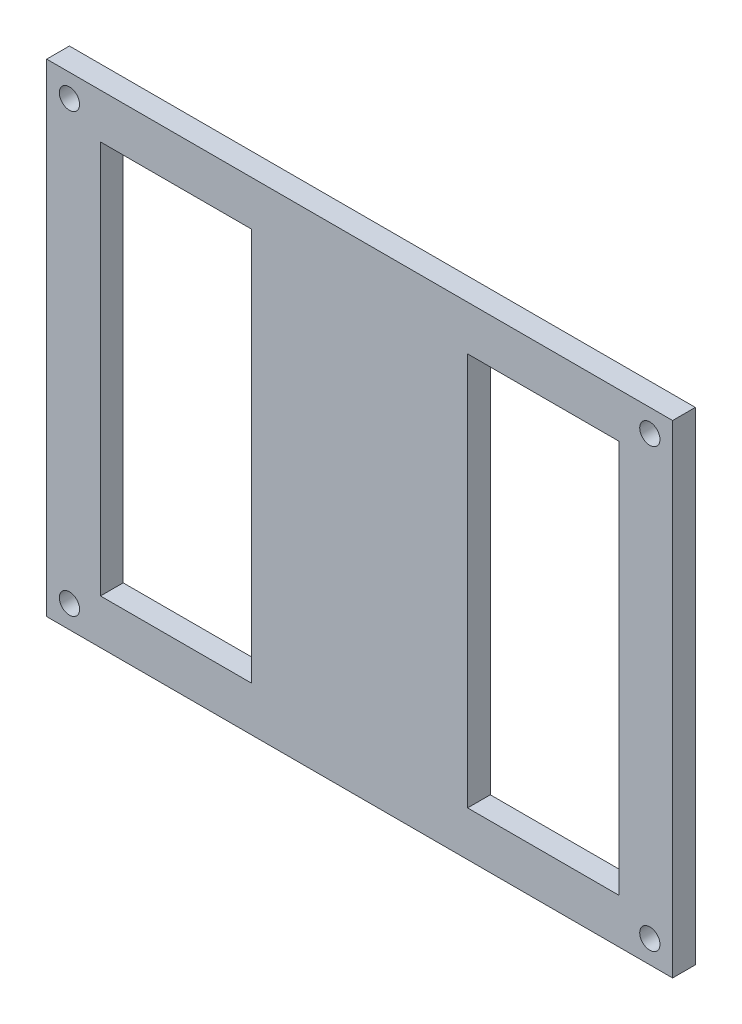
ISO-10303-21;
HEADER;
FILE_DESCRIPTION(('STEP AP214'),'2;1');
FILE_NAME('part.step','',(''),(''),'','','');
FILE_SCHEMA(('AUTOMOTIVE_DESIGN { 1 0 10303 214 1 1 1 1 }'));
ENDSEC;
DATA;
#1=APPLICATION_CONTEXT('core data for automotive mechanical design processes');
#2=APPLICATION_PROTOCOL_DEFINITION('international standard','automotive_design',2000,#1);
#3=PRODUCT_CONTEXT('',#1,'mechanical');
#4=PRODUCT('Part','Part','',(#3));
#5=PRODUCT_RELATED_PRODUCT_CATEGORY('part','',(#4));
#6=PRODUCT_DEFINITION_FORMATION('','',#4);
#7=PRODUCT_DEFINITION_CONTEXT('part definition',#1,'design');
#8=PRODUCT_DEFINITION('design','',#6,#7);
#9=PRODUCT_DEFINITION_SHAPE('','',#8);
#10=(LENGTH_UNIT() NAMED_UNIT(*) SI_UNIT(.MILLI.,.METRE.));
#11=(NAMED_UNIT(*) PLANE_ANGLE_UNIT() SI_UNIT($,.RADIAN.));
#12=(NAMED_UNIT(*) SI_UNIT($,.STERADIAN.) SOLID_ANGLE_UNIT());
#13=UNCERTAINTY_MEASURE_WITH_UNIT(LENGTH_MEASURE(1.E-05),#10,'distance_accuracy_value','');
#14=(GEOMETRIC_REPRESENTATION_CONTEXT(3) GLOBAL_UNCERTAINTY_ASSIGNED_CONTEXT((#13)) GLOBAL_UNIT_ASSIGNED_CONTEXT((#10,
#11,#12)) REPRESENTATION_CONTEXT('',''));
#15=CARTESIAN_POINT('',(0.,0.,0.));
#16=DIRECTION('',(0.,0.,1.));
#17=DIRECTION('',(1.,0.,0.));
#18=AXIS2_PLACEMENT_3D('',#15,#16,#17);
#19=CARTESIAN_POINT('',(0.,0.,0.));
#20=DIRECTION('',(0.,0.,1.));
#21=DIRECTION('',(1.,0.,0.));
#22=AXIS2_PLACEMENT_3D('',#19,#20,#21);
#23=PLANE('',#22);
#24=DIRECTION('',(1.,0.,0.));
#25=VECTOR('',#24,1.);
#26=CARTESIAN_POINT('',(-25.65,27.475,0.));
#27=LINE('',#26,#25);
#28=CARTESIAN_POINT('',(-36.215,27.475,0.));
#29=VERTEX_POINT('',#28);
#30=CARTESIAN_POINT('',(-15.085,27.475,0.));
#31=VERTEX_POINT('',#30);
#32=EDGE_CURVE('E243',#29,#31,#27,.T.);
#33=ORIENTED_EDGE('',*,*,#32,.F.);
#34=DIRECTION('',(0.,1.,0.));
#35=VECTOR('',#34,1.);
#36=CARTESIAN_POINT('',(-36.215,0.,0.));
#37=LINE('',#36,#35);
#38=CARTESIAN_POINT('',(-36.215,-27.475,0.));
#39=VERTEX_POINT('',#38);
#40=EDGE_CURVE('E55',#39,#29,#37,.T.);
#41=ORIENTED_EDGE('',*,*,#40,.F.);
#42=DIRECTION('',(-1.,0.,0.));
#43=VECTOR('',#42,1.);
#44=CARTESIAN_POINT('',(-15.085,-27.475,0.));
#45=LINE('',#44,#43);
#46=CARTESIAN_POINT('',(-15.085,-27.475,0.));
#47=VERTEX_POINT('',#46);
#48=EDGE_CURVE('E267',#47,#39,#45,.T.);
#49=ORIENTED_EDGE('',*,*,#48,.F.);
#50=DIRECTION('',(0.,1.,0.));
#51=VECTOR('',#50,1.);
#52=CARTESIAN_POINT('',(-15.085,0.,0.));
#53=LINE('',#52,#51);
#54=EDGE_CURVE('E145',#47,#31,#53,.T.);
#55=ORIENTED_EDGE('',*,*,#54,.T.);
#56=EDGE_LOOP('',(#33,#41,#49,#55));
#57=FACE_BOUND('',#56,.T.);
#58=DIRECTION('',(1.,0.,0.));
#59=VECTOR('',#58,1.);
#60=CARTESIAN_POINT('',(25.65,27.475,0.));
#61=LINE('',#60,#59);
#62=CARTESIAN_POINT('',(15.085,27.475,0.));
#63=VERTEX_POINT('',#62);
#64=CARTESIAN_POINT('',(36.215,27.475,0.));
#65=VERTEX_POINT('',#64);
#66=EDGE_CURVE('E257',#63,#65,#61,.T.);
#67=ORIENTED_EDGE('',*,*,#66,.F.);
#68=DIRECTION('',(0.,1.,0.));
#69=VECTOR('',#68,1.);
#70=CARTESIAN_POINT('',(15.085,0.,0.));
#71=LINE('',#70,#69);
#72=CARTESIAN_POINT('',(15.085,-27.475,0.));
#73=VERTEX_POINT('',#72);
#74=EDGE_CURVE('E140',#73,#63,#71,.T.);
#75=ORIENTED_EDGE('',*,*,#74,.F.);
#76=DIRECTION('',(-1.,0.,0.));
#77=VECTOR('',#76,1.);
#78=CARTESIAN_POINT('',(36.215,-27.475,0.));
#79=LINE('',#78,#77);
#80=CARTESIAN_POINT('',(36.215,-27.475,0.));
#81=VERTEX_POINT('',#80);
#82=EDGE_CURVE('E125',#81,#73,#79,.T.);
#83=ORIENTED_EDGE('',*,*,#82,.F.);
#84=DIRECTION('',(0.,1.,0.));
#85=VECTOR('',#84,1.);
#86=CARTESIAN_POINT('',(36.215,0.,0.));
#87=LINE('',#86,#85);
#88=EDGE_CURVE('E138',#81,#65,#87,.T.);
#89=ORIENTED_EDGE('',*,*,#88,.T.);
#90=EDGE_LOOP('',(#67,#75,#83,#89));
#91=FACE_BOUND('',#90,.T.);
#92=CARTESIAN_POINT('',(40.5530194846605,30.5530194846606,0.));
#93=DIRECTION('',(0.,0.,1.));
#94=DIRECTION('',(1.,0.,0.));
#95=AXIS2_PLACEMENT_3D('',#92,#93,#94);
#96=CIRCLE('',#95,1.415);
#97=CARTESIAN_POINT('',(41.9680194846605,30.5530194846606,0.));
#98=VERTEX_POINT('',#97);
#99=EDGE_CURVE('E175',#98,#98,#96,.T.);
#100=ORIENTED_EDGE('',*,*,#99,.T.);
#101=EDGE_LOOP('',(#100));
#102=FACE_BOUND('',#101,.T.);
#103=CARTESIAN_POINT('',(40.5530194846605,-30.5530194846605,0.));
#104=DIRECTION('',(0.,0.,1.));
#105=DIRECTION('',(1.,0.,0.));
#106=AXIS2_PLACEMENT_3D('',#103,#104,#105);
#107=CIRCLE('',#106,1.415);
#108=CARTESIAN_POINT('',(41.9680194846605,-30.5530194846605,0.));
#109=VERTEX_POINT('',#108);
#110=EDGE_CURVE('E172',#109,#109,#107,.T.);
#111=ORIENTED_EDGE('',*,*,#110,.T.);
#112=EDGE_LOOP('',(#111));
#113=FACE_BOUND('',#112,.T.);
#114=CARTESIAN_POINT('',(-40.5530194846605,-30.5530194846606,0.));
#115=DIRECTION('',(0.,0.,1.));
#116=DIRECTION('',(1.,0.,0.));
#117=AXIS2_PLACEMENT_3D('',#114,#115,#116);
#118=CIRCLE('',#117,1.415);
#119=CARTESIAN_POINT('',(-39.1380194846605,-30.5530194846606,0.));
#120=VERTEX_POINT('',#119);
#121=EDGE_CURVE('E169',#120,#120,#118,.T.);
#122=ORIENTED_EDGE('',*,*,#121,.T.);
#123=EDGE_LOOP('',(#122));
#124=FACE_BOUND('',#123,.T.);
#125=CARTESIAN_POINT('',(-40.5530194846605,30.5530194846606,0.));
#126=DIRECTION('',(0.,0.,1.));
#127=DIRECTION('',(1.,0.,0.));
#128=AXIS2_PLACEMENT_3D('',#125,#126,#127);
#129=CIRCLE('',#128,1.415);
#130=CARTESIAN_POINT('',(-39.1380194846605,30.5530194846606,0.));
#131=VERTEX_POINT('',#130);
#132=EDGE_CURVE('E166',#131,#131,#129,.T.);
#133=ORIENTED_EDGE('',*,*,#132,.T.);
#134=EDGE_LOOP('',(#133));
#135=FACE_BOUND('',#134,.T.);
#136=DIRECTION('',(0.,1.,0.));
#137=VECTOR('',#136,1.);
#138=CARTESIAN_POINT('',(43.735,0.,0.));
#139=LINE('',#138,#137);
#140=CARTESIAN_POINT('',(43.735,-33.735,0.));
#141=VERTEX_POINT('',#140);
#142=CARTESIAN_POINT('',(43.735,33.735,0.));
#143=VERTEX_POINT('',#142);
#144=EDGE_CURVE('E11',#141,#143,#139,.T.);
#145=ORIENTED_EDGE('',*,*,#144,.F.);
#146=DIRECTION('',(1.,0.,0.));
#147=VECTOR('',#146,1.);
#148=CARTESIAN_POINT('',(0.,-33.735,0.));
#149=LINE('',#148,#147);
#150=CARTESIAN_POINT('',(-43.735,-33.735,0.));
#151=VERTEX_POINT('',#150);
#152=EDGE_CURVE('E43',#151,#141,#149,.T.);
#153=ORIENTED_EDGE('',*,*,#152,.F.);
#154=DIRECTION('',(0.,-1.,0.));
#155=VECTOR('',#154,1.);
#156=CARTESIAN_POINT('',(-43.735,0.,0.));
#157=LINE('',#156,#155);
#158=CARTESIAN_POINT('',(-43.735,33.735,0.));
#159=VERTEX_POINT('',#158);
#160=EDGE_CURVE('E201',#159,#151,#157,.T.);
#161=ORIENTED_EDGE('',*,*,#160,.F.);
#162=DIRECTION('',(-1.,0.,0.));
#163=VECTOR('',#162,1.);
#164=CARTESIAN_POINT('',(0.,33.735,0.));
#165=LINE('',#164,#163);
#166=EDGE_CURVE('E193',#143,#159,#165,.T.);
#167=ORIENTED_EDGE('',*,*,#166,.F.);
#168=EDGE_LOOP('',(#145,#153,#161,#167));
#169=FACE_BOUND('',#168,.T.);
#170=ADVANCED_FACE('F36',(#57,#91,#102,#113,#124,#135,#169),#23,.F.);
#171=CARTESIAN_POINT('',(43.735,33.735,-6.825));
#172=DIRECTION('',(1.,0.,0.));
#173=DIRECTION('',(0.,1.,0.));
#174=AXIS2_PLACEMENT_3D('',#171,#172,#173);
#175=PLANE('',#174);
#176=ORIENTED_EDGE('',*,*,#144,.T.);
#177=DIRECTION('',(0.,0.,1.));
#178=VECTOR('',#177,1.);
#179=CARTESIAN_POINT('',(43.735,33.735,-6.825));
#180=LINE('',#179,#178);
#181=CARTESIAN_POINT('',(43.735,33.735,3.175));
#182=VERTEX_POINT('',#181);
#183=EDGE_CURVE('E190',#143,#182,#180,.T.);
#184=ORIENTED_EDGE('',*,*,#183,.T.);
#185=DIRECTION('',(0.,1.,0.));
#186=VECTOR('',#185,1.);
#187=CARTESIAN_POINT('',(43.735,33.735,3.175));
#188=LINE('',#187,#186);
#189=CARTESIAN_POINT('',(43.735,-33.735,3.175));
#190=VERTEX_POINT('',#189);
#191=EDGE_CURVE('E178',#190,#182,#188,.T.);
#192=ORIENTED_EDGE('',*,*,#191,.F.);
#193=DIRECTION('',(0.,0.,1.));
#194=VECTOR('',#193,1.);
#195=CARTESIAN_POINT('',(43.735,-33.735,-6.825));
#196=LINE('',#195,#194);
#197=EDGE_CURVE('E191',#141,#190,#196,.T.);
#198=ORIENTED_EDGE('',*,*,#197,.F.);
#199=EDGE_LOOP('',(#176,#184,#192,#198));
#200=FACE_BOUND('',#199,.T.);
#201=ADVANCED_FACE('F213',(#200),#175,.T.);
#202=CARTESIAN_POINT('',(-43.735,-33.735,-6.825));
#203=DIRECTION('',(0.,-1.,0.));
#204=DIRECTION('',(0.,0.,-1.));
#205=AXIS2_PLACEMENT_3D('',#202,#203,#204);
#206=PLANE('',#205);
#207=ORIENTED_EDGE('',*,*,#152,.T.);
#208=ORIENTED_EDGE('',*,*,#197,.T.);
#209=DIRECTION('',(1.,0.,0.));
#210=VECTOR('',#209,1.);
#211=CARTESIAN_POINT('',(-43.735,-33.735,3.175));
#212=LINE('',#211,#210);
#213=CARTESIAN_POINT('',(-43.735,-33.735,3.175));
#214=VERTEX_POINT('',#213);
#215=EDGE_CURVE('E187',#214,#190,#212,.T.);
#216=ORIENTED_EDGE('',*,*,#215,.F.);
#217=DIRECTION('',(0.,0.,1.));
#218=VECTOR('',#217,1.);
#219=CARTESIAN_POINT('',(-43.735,-33.735,-6.825));
#220=LINE('',#219,#218);
#221=EDGE_CURVE('E194',#151,#214,#220,.T.);
#222=ORIENTED_EDGE('',*,*,#221,.F.);
#223=EDGE_LOOP('',(#207,#208,#216,#222));
#224=FACE_BOUND('',#223,.T.);
#225=ADVANCED_FACE('F206',(#224),#206,.T.);
#226=CARTESIAN_POINT('',(-43.735,33.735,-6.825));
#227=DIRECTION('',(-1.,0.,0.));
#228=DIRECTION('',(0.,-1.,0.));
#229=AXIS2_PLACEMENT_3D('',#226,#227,#228);
#230=PLANE('',#229);
#231=ORIENTED_EDGE('',*,*,#160,.T.);
#232=ORIENTED_EDGE('',*,*,#221,.T.);
#233=DIRECTION('',(0.,-1.,0.));
#234=VECTOR('',#233,1.);
#235=CARTESIAN_POINT('',(-43.735,33.735,3.175));
#236=LINE('',#235,#234);
#237=CARTESIAN_POINT('',(-43.735,33.735,3.175));
#238=VERTEX_POINT('',#237);
#239=EDGE_CURVE('E184',#238,#214,#236,.T.);
#240=ORIENTED_EDGE('',*,*,#239,.F.);
#241=DIRECTION('',(0.,0.,1.));
#242=VECTOR('',#241,1.);
#243=CARTESIAN_POINT('',(-43.735,33.735,-6.825));
#244=LINE('',#243,#242);
#245=EDGE_CURVE('E196',#159,#238,#244,.T.);
#246=ORIENTED_EDGE('',*,*,#245,.F.);
#247=EDGE_LOOP('',(#231,#232,#240,#246));
#248=FACE_BOUND('',#247,.T.);
#249=ADVANCED_FACE('F220',(#248),#230,.T.);
#250=CARTESIAN_POINT('',(-43.735,33.735,-6.825));
#251=DIRECTION('',(0.,1.,0.));
#252=DIRECTION('',(0.,0.,1.));
#253=AXIS2_PLACEMENT_3D('',#250,#251,#252);
#254=PLANE('',#253);
#255=ORIENTED_EDGE('',*,*,#166,.T.);
#256=ORIENTED_EDGE('',*,*,#245,.T.);
#257=DIRECTION('',(-1.,0.,0.));
#258=VECTOR('',#257,1.);
#259=CARTESIAN_POINT('',(-43.735,33.735,3.175));
#260=LINE('',#259,#258);
#261=EDGE_CURVE('E181',#182,#238,#260,.T.);
#262=ORIENTED_EDGE('',*,*,#261,.F.);
#263=ORIENTED_EDGE('',*,*,#183,.F.);
#264=EDGE_LOOP('',(#255,#256,#262,#263));
#265=FACE_BOUND('',#264,.T.);
#266=ADVANCED_FACE('F217',(#265),#254,.T.);
#267=CARTESIAN_POINT('',(0.,0.,3.175));
#268=DIRECTION('',(0.,0.,1.));
#269=DIRECTION('',(1.,0.,0.));
#270=AXIS2_PLACEMENT_3D('',#267,#268,#269);
#271=PLANE('',#270);
#272=DIRECTION('',(0.,1.,0.));
#273=VECTOR('',#272,1.);
#274=CARTESIAN_POINT('',(-36.215,-32.565,3.175));
#275=LINE('',#274,#273);
#276=CARTESIAN_POINT('',(-36.215,-27.475,3.175));
#277=VERTEX_POINT('',#276);
#278=CARTESIAN_POINT('',(-36.215,27.475,3.175));
#279=VERTEX_POINT('',#278);
#280=EDGE_CURVE('E149',#277,#279,#275,.T.);
#281=ORIENTED_EDGE('',*,*,#280,.T.);
#282=DIRECTION('',(1.,0.,0.));
#283=VECTOR('',#282,1.);
#284=CARTESIAN_POINT('',(-15.085,27.475,3.175));
#285=LINE('',#284,#283);
#286=CARTESIAN_POINT('',(-15.085,27.475,3.175));
#287=VERTEX_POINT('',#286);
#288=EDGE_CURVE('E249',#279,#287,#285,.T.);
#289=ORIENTED_EDGE('',*,*,#288,.T.);
#290=DIRECTION('',(0.,1.,0.));
#291=VECTOR('',#290,1.);
#292=CARTESIAN_POINT('',(-15.085,-32.565,3.175));
#293=LINE('',#292,#291);
#294=CARTESIAN_POINT('',(-15.085,-27.475,3.175));
#295=VERTEX_POINT('',#294);
#296=EDGE_CURVE('E278',#295,#287,#293,.T.);
#297=ORIENTED_EDGE('',*,*,#296,.F.);
#298=DIRECTION('',(-1.,0.,0.));
#299=VECTOR('',#298,1.);
#300=CARTESIAN_POINT('',(-25.65,-27.475,3.175));
#301=LINE('',#300,#299);
#302=EDGE_CURVE('E265',#295,#277,#301,.T.);
#303=ORIENTED_EDGE('',*,*,#302,.T.);
#304=EDGE_LOOP('',(#281,#289,#297,#303));
#305=FACE_BOUND('',#304,.T.);
#306=DIRECTION('',(0.,1.,0.));
#307=VECTOR('',#306,1.);
#308=CARTESIAN_POINT('',(15.085,-32.565,3.175));
#309=LINE('',#308,#307);
#310=CARTESIAN_POINT('',(15.085,-27.475,3.175));
#311=VERTEX_POINT('',#310);
#312=CARTESIAN_POINT('',(15.085,27.475,3.175));
#313=VERTEX_POINT('',#312);
#314=EDGE_CURVE('E275',#311,#313,#309,.T.);
#315=ORIENTED_EDGE('',*,*,#314,.T.);
#316=DIRECTION('',(1.,0.,0.));
#317=VECTOR('',#316,1.);
#318=CARTESIAN_POINT('',(36.215,27.475,3.175));
#319=LINE('',#318,#317);
#320=CARTESIAN_POINT('',(36.215,27.475,3.175));
#321=VERTEX_POINT('',#320);
#322=EDGE_CURVE('E255',#313,#321,#319,.T.);
#323=ORIENTED_EDGE('',*,*,#322,.T.);
#324=DIRECTION('',(0.,1.,0.));
#325=VECTOR('',#324,1.);
#326=CARTESIAN_POINT('',(36.215,-32.565,3.175));
#327=LINE('',#326,#325);
#328=CARTESIAN_POINT('',(36.215,-27.475,3.175));
#329=VERTEX_POINT('',#328);
#330=EDGE_CURVE('E280',#329,#321,#327,.T.);
#331=ORIENTED_EDGE('',*,*,#330,.F.);
#332=DIRECTION('',(-1.,0.,0.));
#333=VECTOR('',#332,1.);
#334=CARTESIAN_POINT('',(25.65,-27.475,3.175));
#335=LINE('',#334,#333);
#336=EDGE_CURVE('E127',#329,#311,#335,.T.);
#337=ORIENTED_EDGE('',*,*,#336,.T.);
#338=EDGE_LOOP('',(#315,#323,#331,#337));
#339=FACE_BOUND('',#338,.T.);
#340=CARTESIAN_POINT('',(40.5530194846605,30.5530194846606,3.175));
#341=DIRECTION('',(0.,0.,1.));
#342=DIRECTION('',(-1.,0.,0.));
#343=AXIS2_PLACEMENT_3D('',#340,#341,#342);
#344=CIRCLE('',#343,1.415);
#345=CARTESIAN_POINT('',(39.1380194846605,30.5530194846606,3.175));
#346=VERTEX_POINT('',#345);
#347=EDGE_CURVE('E154',#346,#346,#344,.T.);
#348=ORIENTED_EDGE('',*,*,#347,.F.);
#349=EDGE_LOOP('',(#348));
#350=FACE_BOUND('',#349,.T.);
#351=CARTESIAN_POINT('',(40.5530194846605,-30.5530194846605,3.175));
#352=DIRECTION('',(0.,0.,1.));
#353=DIRECTION('',(1.,0.,0.));
#354=AXIS2_PLACEMENT_3D('',#351,#352,#353);
#355=CIRCLE('',#354,1.415);
#356=CARTESIAN_POINT('',(41.9680194846605,-30.5530194846605,3.175));
#357=VERTEX_POINT('',#356);
#358=EDGE_CURVE('E159',#357,#357,#355,.T.);
#359=ORIENTED_EDGE('',*,*,#358,.F.);
#360=EDGE_LOOP('',(#359));
#361=FACE_BOUND('',#360,.T.);
#362=CARTESIAN_POINT('',(-40.5530194846605,-30.5530194846606,3.175));
#363=DIRECTION('',(0.,0.,1.));
#364=DIRECTION('',(-1.,0.,0.));
#365=AXIS2_PLACEMENT_3D('',#362,#363,#364);
#366=CIRCLE('',#365,1.415);
#367=CARTESIAN_POINT('',(-41.9680194846605,-30.5530194846606,3.175));
#368=VERTEX_POINT('',#367);
#369=EDGE_CURVE('E155',#368,#368,#366,.T.);
#370=ORIENTED_EDGE('',*,*,#369,.F.);
#371=EDGE_LOOP('',(#370));
#372=FACE_BOUND('',#371,.T.);
#373=CARTESIAN_POINT('',(-40.5530194846605,30.5530194846606,3.175));
#374=DIRECTION('',(0.,0.,1.));
#375=DIRECTION('',(1.,0.,0.));
#376=AXIS2_PLACEMENT_3D('',#373,#374,#375);
#377=CIRCLE('',#376,1.415);
#378=CARTESIAN_POINT('',(-39.1380194846605,30.5530194846606,3.175));
#379=VERTEX_POINT('',#378);
#380=EDGE_CURVE('E158',#379,#379,#377,.T.);
#381=ORIENTED_EDGE('',*,*,#380,.F.);
#382=EDGE_LOOP('',(#381));
#383=FACE_BOUND('',#382,.T.);
#384=ORIENTED_EDGE('',*,*,#215,.T.);
#385=ORIENTED_EDGE('',*,*,#191,.T.);
#386=ORIENTED_EDGE('',*,*,#261,.T.);
#387=ORIENTED_EDGE('',*,*,#239,.T.);
#388=EDGE_LOOP('',(#384,#385,#386,#387));
#389=FACE_BOUND('',#388,.T.);
#390=ADVANCED_FACE('F222',(#305,#339,#350,#361,#372,#383,#389),#271,.T.);
#391=CARTESIAN_POINT('',(-40.5530194846605,30.5530194846606,-6.825));
#392=DIRECTION('',(0.,0.,1.));
#393=DIRECTION('',(1.,0.,0.));
#394=AXIS2_PLACEMENT_3D('',#391,#392,#393);
#395=CYLINDRICAL_SURFACE('',#394,1.415);
#396=ORIENTED_EDGE('',*,*,#380,.T.);
#397=EDGE_LOOP('',(#396));
#398=FACE_BOUND('',#397,.T.);
#399=ORIENTED_EDGE('',*,*,#132,.F.);
#400=EDGE_LOOP('',(#399));
#401=FACE_BOUND('',#400,.T.);
#402=ADVANCED_FACE('F224',(#398,#401),#395,.F.);
#403=CARTESIAN_POINT('',(-40.5530194846605,-30.5530194846606,-6.825));
#404=DIRECTION('',(0.,0.,1.));
#405=DIRECTION('',(1.,0.,0.));
#406=AXIS2_PLACEMENT_3D('',#403,#404,#405);
#407=CYLINDRICAL_SURFACE('',#406,1.415);
#408=ORIENTED_EDGE('',*,*,#369,.T.);
#409=EDGE_LOOP('',(#408));
#410=FACE_BOUND('',#409,.T.);
#411=ORIENTED_EDGE('',*,*,#121,.F.);
#412=EDGE_LOOP('',(#411));
#413=FACE_BOUND('',#412,.T.);
#414=ADVANCED_FACE('F230',(#410,#413),#407,.F.);
#415=CARTESIAN_POINT('',(40.5530194846605,-30.5530194846605,-6.825));
#416=DIRECTION('',(0.,0.,1.));
#417=DIRECTION('',(1.,0.,0.));
#418=AXIS2_PLACEMENT_3D('',#415,#416,#417);
#419=CYLINDRICAL_SURFACE('',#418,1.415);
#420=ORIENTED_EDGE('',*,*,#358,.T.);
#421=EDGE_LOOP('',(#420));
#422=FACE_BOUND('',#421,.T.);
#423=ORIENTED_EDGE('',*,*,#110,.F.);
#424=EDGE_LOOP('',(#423));
#425=FACE_BOUND('',#424,.T.);
#426=ADVANCED_FACE('F306',(#422,#425),#419,.F.);
#427=CARTESIAN_POINT('',(40.5530194846605,30.5530194846606,-6.825));
#428=DIRECTION('',(0.,0.,1.));
#429=DIRECTION('',(1.,0.,0.));
#430=AXIS2_PLACEMENT_3D('',#427,#428,#429);
#431=CYLINDRICAL_SURFACE('',#430,1.415);
#432=ORIENTED_EDGE('',*,*,#347,.T.);
#433=EDGE_LOOP('',(#432));
#434=FACE_BOUND('',#433,.T.);
#435=ORIENTED_EDGE('',*,*,#99,.F.);
#436=EDGE_LOOP('',(#435));
#437=FACE_BOUND('',#436,.T.);
#438=ADVANCED_FACE('F300',(#434,#437),#431,.F.);
#439=CARTESIAN_POINT('',(36.215,-32.565,-6.825));
#440=DIRECTION('',(1.,0.,0.));
#441=DIRECTION('',(0.,0.,-1.));
#442=AXIS2_PLACEMENT_3D('',#439,#440,#441);
#443=PLANE('',#442);
#444=ORIENTED_EDGE('',*,*,#330,.T.);
#445=DIRECTION('',(0.,0.,1.));
#446=VECTOR('',#445,1.);
#447=CARTESIAN_POINT('',(36.215,27.475,0.));
#448=LINE('',#447,#446);
#449=EDGE_CURVE('E144',#65,#321,#448,.T.);
#450=ORIENTED_EDGE('',*,*,#449,.F.);
#451=ORIENTED_EDGE('',*,*,#88,.F.);
#452=DIRECTION('',(0.,0.,1.));
#453=VECTOR('',#452,1.);
#454=CARTESIAN_POINT('',(36.215,-27.475,0.));
#455=LINE('',#454,#453);
#456=EDGE_CURVE('E121',#81,#329,#455,.T.);
#457=ORIENTED_EDGE('',*,*,#456,.T.);
#458=EDGE_LOOP('',(#444,#450,#451,#457));
#459=FACE_BOUND('',#458,.T.);
#460=ADVANCED_FACE('F142',(#459),#443,.F.);
#461=CARTESIAN_POINT('',(15.085,-32.565,-6.825));
#462=DIRECTION('',(1.,0.,0.));
#463=DIRECTION('',(0.,1.,0.));
#464=AXIS2_PLACEMENT_3D('',#461,#462,#463);
#465=PLANE('',#464);
#466=DIRECTION('',(0.,0.,1.));
#467=VECTOR('',#466,1.);
#468=CARTESIAN_POINT('',(15.085,27.475,0.));
#469=LINE('',#468,#467);
#470=EDGE_CURVE('E261',#63,#313,#469,.T.);
#471=ORIENTED_EDGE('',*,*,#470,.T.);
#472=ORIENTED_EDGE('',*,*,#314,.F.);
#473=DIRECTION('',(0.,0.,1.));
#474=VECTOR('',#473,1.);
#475=CARTESIAN_POINT('',(15.085,-27.475,0.));
#476=LINE('',#475,#474);
#477=EDGE_CURVE('E131',#73,#311,#476,.T.);
#478=ORIENTED_EDGE('',*,*,#477,.F.);
#479=ORIENTED_EDGE('',*,*,#74,.T.);
#480=EDGE_LOOP('',(#471,#472,#478,#479));
#481=FACE_BOUND('',#480,.T.);
#482=ADVANCED_FACE('F290',(#481),#465,.T.);
#483=CARTESIAN_POINT('',(-36.215,-32.565,-6.825));
#484=DIRECTION('',(1.,0.,0.));
#485=DIRECTION('',(0.,0.,-1.));
#486=AXIS2_PLACEMENT_3D('',#483,#484,#485);
#487=PLANE('',#486);
#488=DIRECTION('',(0.,0.,1.));
#489=VECTOR('',#488,1.);
#490=CARTESIAN_POINT('',(-36.215,27.475,0.));
#491=LINE('',#490,#489);
#492=EDGE_CURVE('E50',#29,#279,#491,.T.);
#493=ORIENTED_EDGE('',*,*,#492,.T.);
#494=ORIENTED_EDGE('',*,*,#280,.F.);
#495=DIRECTION('',(0.,0.,1.));
#496=VECTOR('',#495,1.);
#497=CARTESIAN_POINT('',(-36.215,-27.475,0.));
#498=LINE('',#497,#496);
#499=EDGE_CURVE('E272',#39,#277,#498,.T.);
#500=ORIENTED_EDGE('',*,*,#499,.F.);
#501=ORIENTED_EDGE('',*,*,#40,.T.);
#502=EDGE_LOOP('',(#493,#494,#500,#501));
#503=FACE_BOUND('',#502,.T.);
#504=ADVANCED_FACE('F292',(#503),#487,.T.);
#505=CARTESIAN_POINT('',(-15.085,-32.565,-6.825));
#506=DIRECTION('',(1.,0.,0.));
#507=DIRECTION('',(0.,1.,0.));
#508=AXIS2_PLACEMENT_3D('',#505,#506,#507);
#509=PLANE('',#508);
#510=ORIENTED_EDGE('',*,*,#296,.T.);
#511=DIRECTION('',(0.,0.,1.));
#512=VECTOR('',#511,1.);
#513=CARTESIAN_POINT('',(-15.085,27.475,0.));
#514=LINE('',#513,#512);
#515=EDGE_CURVE('E248',#31,#287,#514,.T.);
#516=ORIENTED_EDGE('',*,*,#515,.F.);
#517=ORIENTED_EDGE('',*,*,#54,.F.);
#518=DIRECTION('',(0.,0.,1.));
#519=VECTOR('',#518,1.);
#520=CARTESIAN_POINT('',(-15.085,-27.475,0.));
#521=LINE('',#520,#519);
#522=EDGE_CURVE('E269',#47,#295,#521,.T.);
#523=ORIENTED_EDGE('',*,*,#522,.T.);
#524=EDGE_LOOP('',(#510,#516,#517,#523));
#525=FACE_BOUND('',#524,.T.);
#526=ADVANCED_FACE('F298',(#525),#509,.F.);
#527=CARTESIAN_POINT('',(-25.65,-27.475,0.));
#528=DIRECTION('',(0.,1.,0.));
#529=DIRECTION('',(0.,0.,1.));
#530=AXIS2_PLACEMENT_3D('',#527,#528,#529);
#531=PLANE('',#530);
#532=ORIENTED_EDGE('',*,*,#302,.F.);
#533=ORIENTED_EDGE('',*,*,#522,.F.);
#534=ORIENTED_EDGE('',*,*,#48,.T.);
#535=ORIENTED_EDGE('',*,*,#499,.T.);
#536=EDGE_LOOP('',(#532,#533,#534,#535));
#537=FACE_BOUND('',#536,.T.);
#538=ADVANCED_FACE('F386',(#537),#531,.T.);
#539=CARTESIAN_POINT('',(25.65,-27.475,0.));
#540=DIRECTION('',(0.,1.,0.));
#541=DIRECTION('',(0.,0.,1.));
#542=AXIS2_PLACEMENT_3D('',#539,#540,#541);
#543=PLANE('',#542);
#544=ORIENTED_EDGE('',*,*,#336,.F.);
#545=ORIENTED_EDGE('',*,*,#456,.F.);
#546=ORIENTED_EDGE('',*,*,#82,.T.);
#547=ORIENTED_EDGE('',*,*,#477,.T.);
#548=EDGE_LOOP('',(#544,#545,#546,#547));
#549=FACE_BOUND('',#548,.T.);
#550=ADVANCED_FACE('F123',(#549),#543,.T.);
#551=CARTESIAN_POINT('',(36.215,27.475,0.));
#552=DIRECTION('',(0.,-1.,0.));
#553=DIRECTION('',(0.,0.,-1.));
#554=AXIS2_PLACEMENT_3D('',#551,#552,#553);
#555=PLANE('',#554);
#556=ORIENTED_EDGE('',*,*,#322,.F.);
#557=ORIENTED_EDGE('',*,*,#470,.F.);
#558=ORIENTED_EDGE('',*,*,#66,.T.);
#559=ORIENTED_EDGE('',*,*,#449,.T.);
#560=EDGE_LOOP('',(#556,#557,#558,#559));
#561=FACE_BOUND('',#560,.T.);
#562=ADVANCED_FACE('F285',(#561),#555,.T.);
#563=CARTESIAN_POINT('',(-15.085,27.475,0.));
#564=DIRECTION('',(0.,-1.,0.));
#565=DIRECTION('',(0.,0.,-1.));
#566=AXIS2_PLACEMENT_3D('',#563,#564,#565);
#567=PLANE('',#566);
#568=ORIENTED_EDGE('',*,*,#288,.F.);
#569=ORIENTED_EDGE('',*,*,#492,.F.);
#570=ORIENTED_EDGE('',*,*,#32,.T.);
#571=ORIENTED_EDGE('',*,*,#515,.T.);
#572=EDGE_LOOP('',(#568,#569,#570,#571));
#573=FACE_BOUND('',#572,.T.);
#574=ADVANCED_FACE('F415',(#573),#567,.T.);
#575=CLOSED_SHELL('',(#170,#201,#225,#249,#266,#390,#402,#414,#426,#438,#460,#482,#504,#526,
#538,#550,#562,#574));
#576=MANIFOLD_SOLID_BREP('B2',#575);
#577=ADVANCED_BREP_SHAPE_REPRESENTATION('',(#18,#576),#14);
#578=SHAPE_DEFINITION_REPRESENTATION(#9,#577);
ENDSEC;
END-ISO-10303-21;
